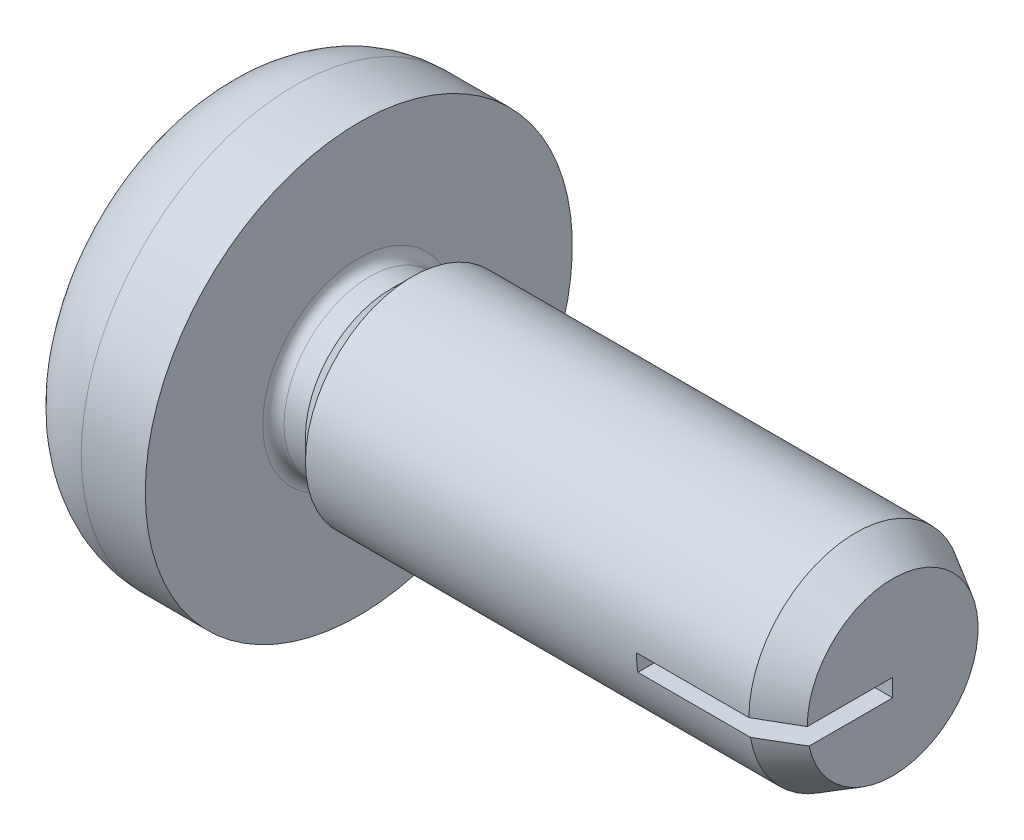
ISO-10303-21;
HEADER;
FILE_DESCRIPTION(('STEP AP214'),'2;1');
FILE_NAME('part.step','',(''),(''),'','','');
FILE_SCHEMA(('AUTOMOTIVE_DESIGN { 1 0 10303 214 1 1 1 1 }'));
ENDSEC;
DATA;
#1=APPLICATION_CONTEXT('core data for automotive mechanical design processes');
#2=APPLICATION_PROTOCOL_DEFINITION('international standard','automotive_design',2000,#1);
#3=PRODUCT_CONTEXT('',#1,'mechanical');
#4=PRODUCT('Part','Part','',(#3));
#5=PRODUCT_RELATED_PRODUCT_CATEGORY('part','',(#4));
#6=PRODUCT_DEFINITION_FORMATION('','',#4);
#7=PRODUCT_DEFINITION_CONTEXT('part definition',#1,'design');
#8=PRODUCT_DEFINITION('design','',#6,#7);
#9=PRODUCT_DEFINITION_SHAPE('','',#8);
#10=(LENGTH_UNIT() NAMED_UNIT(*) SI_UNIT(.MILLI.,.METRE.));
#11=(NAMED_UNIT(*) PLANE_ANGLE_UNIT() SI_UNIT($,.RADIAN.));
#12=(NAMED_UNIT(*) SI_UNIT($,.STERADIAN.) SOLID_ANGLE_UNIT());
#13=UNCERTAINTY_MEASURE_WITH_UNIT(LENGTH_MEASURE(1.E-05),#10,'distance_accuracy_value','');
#14=(GEOMETRIC_REPRESENTATION_CONTEXT(3) GLOBAL_UNCERTAINTY_ASSIGNED_CONTEXT((#13)) GLOBAL_UNIT_ASSIGNED_CONTEXT((#10,
#11,#12)) REPRESENTATION_CONTEXT('',''));
#15=CARTESIAN_POINT('',(0.,0.,0.));
#16=DIRECTION('',(0.,0.,1.));
#17=DIRECTION('',(1.,0.,0.));
#18=AXIS2_PLACEMENT_3D('',#15,#16,#17);
#19=CARTESIAN_POINT('',(0.,0.,0.));
#20=DIRECTION('',(-1.,0.,0.));
#21=DIRECTION('',(0.,0.,1.));
#22=AXIS2_PLACEMENT_3D('',#19,#20,#21);
#23=CYLINDRICAL_SURFACE('',#22,4.);
#24=CARTESIAN_POINT('',(7.6,0.,0.));
#25=DIRECTION('',(-1.,0.,0.));
#26=DIRECTION('',(0.,0.,1.));
#27=AXIS2_PLACEMENT_3D('',#24,#25,#26);
#28=CIRCLE('',#27,4.);
#29=CARTESIAN_POINT('',(7.6,0.,4.));
#30=VERTEX_POINT('',#29);
#31=EDGE_CURVE('E234',#30,#30,#28,.T.);
#32=ORIENTED_EDGE('',*,*,#31,.F.);
#33=EDGE_LOOP('',(#32));
#34=FACE_BOUND('',#33,.T.);
#35=DIRECTION('',(-1.,0.,0.));
#36=VECTOR('',#35,1.);
#37=CARTESIAN_POINT('',(0.,0.,4.));
#38=LINE('',#37,#36);
#39=CARTESIAN_POINT('',(24.2143593539449,0.,4.));
#40=VERTEX_POINT('',#39);
#41=CARTESIAN_POINT('',(20.,0.,4.));
#42=VERTEX_POINT('',#41);
#43=EDGE_CURVE('E376',#40,#42,#38,.T.);
#44=ORIENTED_EDGE('',*,*,#43,.F.);
#45=CARTESIAN_POINT('',(24.2143593539449,0.,0.));
#46=DIRECTION('',(-1.,0.,0.));
#47=DIRECTION('',(0.,0.,1.));
#48=AXIS2_PLACEMENT_3D('',#45,#46,#47);
#49=CIRCLE('',#48,4.);
#50=CARTESIAN_POINT('',(24.2143593539449,-0.666666666666667,3.94405318873308));
#51=VERTEX_POINT('',#50);
#52=EDGE_CURVE('E373',#40,#51,#49,.T.);
#53=ORIENTED_EDGE('',*,*,#52,.T.);
#54=DIRECTION('',(-1.,0.,0.));
#55=VECTOR('',#54,1.);
#56=CARTESIAN_POINT('',(0.,-0.66666666666667,3.94405318873308));
#57=LINE('',#56,#55);
#58=CARTESIAN_POINT('',(20.,-0.666666666666667,3.94405318873308));
#59=VERTEX_POINT('',#58);
#60=EDGE_CURVE('E380',#59,#51,#57,.F.);
#61=ORIENTED_EDGE('',*,*,#60,.F.);
#62=CARTESIAN_POINT('',(20.,0.,0.));
#63=DIRECTION('',(1.,0.,0.));
#64=DIRECTION('',(0.,0.,-1.));
#65=AXIS2_PLACEMENT_3D('',#62,#63,#64);
#66=CIRCLE('',#65,4.);
#67=EDGE_CURVE('E43',#42,#59,#66,.T.);
#68=ORIENTED_EDGE('',*,*,#67,.F.);
#69=EDGE_LOOP('',(#44,#53,#61,#68));
#70=FACE_BOUND('',#69,.T.);
#71=ADVANCED_FACE('F70',(#34,#70),#23,.T.);
#72=CARTESIAN_POINT('',(24.2143593539449,0.,0.));
#73=DIRECTION('',(-1.,0.,0.));
#74=DIRECTION('',(0.,0.,1.));
#75=AXIS2_PLACEMENT_3D('',#72,#73,#74);
#76=CONICAL_SURFACE('',#75,4.,0.523598775598293);
#77=ORIENTED_EDGE('',*,*,#52,.F.);
#78=DIRECTION('',(-0.866025403784441,0.,0.499999999999995));
#79=VECTOR('',#78,1.);
#80=CARTESIAN_POINT('',(31.1425625842205,0.,0.));
#81=LINE('',#80,#79);
#82=CARTESIAN_POINT('',(25.6,0.,3.2));
#83=VERTEX_POINT('',#82);
#84=EDGE_CURVE('E378',#40,#83,#81,.F.);
#85=ORIENTED_EDGE('',*,*,#84,.T.);
#86=CARTESIAN_POINT('',(25.6,0.,0.));
#87=DIRECTION('',(-1.,0.,0.));
#88=DIRECTION('',(0.,0.,1.));
#89=AXIS2_PLACEMENT_3D('',#86,#87,#88);
#90=CIRCLE('',#89,3.2);
#91=CARTESIAN_POINT('',(25.6,-0.666666666666667,3.12978522514813));
#92=VERTEX_POINT('',#91);
#93=EDGE_CURVE('E232',#83,#92,#90,.T.);
#94=ORIENTED_EDGE('',*,*,#93,.T.);
#95=CARTESIAN_POINT('',(29.0110225737498,-0.666666666666666,1.03442890570983));
#96=CARTESIAN_POINT('',(28.9546047360862,-0.666666666666666,1.07316230279422));
#97=CARTESIAN_POINT('',(28.8979084191792,-0.666666666666666,1.11148539170131));
#98=CARTESIAN_POINT('',(28.7840766646169,-0.666666666666666,1.18746837836424));
#99=CARTESIAN_POINT('',(28.7269412485431,-0.666666666666666,1.2251283084183));
#100=CARTESIAN_POINT('',(28.6123511503539,-0.666666666666666,1.29994122551413));
#101=CARTESIAN_POINT('',(28.5548965113001,-0.666666666666666,1.33709427870161));
#102=CARTESIAN_POINT('',(28.4397288887015,-0.666666666666666,1.41099927061029));
#103=CARTESIAN_POINT('',(28.3820159015085,-0.666666666666666,1.44775120364183));
#104=CARTESIAN_POINT('',(28.2085999099586,-0.666666666666666,1.55751052864889));
#105=CARTESIAN_POINT('',(28.0925936030097,-0.666666666666666,1.63003848501711));
#106=CARTESIAN_POINT('',(27.860039620016,-0.666666666666666,1.77422946995291));
#107=CARTESIAN_POINT('',(27.7434919213131,-0.666666666666666,1.84589246186038));
#108=CARTESIAN_POINT('',(27.4030460845038,-0.666666666666666,2.05400292151073));
#109=CARTESIAN_POINT('',(27.1786501670724,-0.666666666666666,2.18963540679998));
#110=CARTESIAN_POINT('',(26.7291021401079,-0.666666666666666,2.45963129973836));
#111=CARTESIAN_POINT('',(26.5039500382249,-0.666666666666667,2.59399472017408));
#112=CARTESIAN_POINT('',(26.0531203270533,-0.666666666666667,2.8619414023947));
#113=CARTESIAN_POINT('',(25.827442620258,-0.666666666666667,2.99552450006476));
#114=CARTESIAN_POINT('',(25.3757682789441,-0.666666666666667,3.26215053511295));
#115=CARTESIAN_POINT('',(25.1497716440183,-0.666666666666667,3.39519347180053));
#116=CARTESIAN_POINT('',(24.5796331830894,-0.666666666666667,3.7301906718806));
#117=CARTESIAN_POINT('',(24.2353456495235,-0.666666666666667,3.93189688810902));
#118=CARTESIAN_POINT('',(23.5464530535666,-0.666666666666667,4.33476598611255));
#119=CARTESIAN_POINT('',(23.2018479911485,-0.666666666666667,4.53592886784144));
#120=CARTESIAN_POINT('',(22.5125601596137,-0.666666666666667,4.93781254608102));
#121=CARTESIAN_POINT('',(22.1678774731129,-0.666666666666667,5.13853348432239));
#122=CARTESIAN_POINT('',(21.4783597959242,-0.666666666666667,5.53971245147009));
#123=CARTESIAN_POINT('',(21.1335248054617,-0.666666666666667,5.74017048076359));
#124=CARTESIAN_POINT('',(20.7886429402508,-0.666666666666667,5.94054763638404));
#125=B_SPLINE_CURVE_WITH_KNOTS('',3,(#95,#96,#97,#98,#99,#100,#101,#102,#103,#104,#105,#106,
#107,#108,#109,#110,#111,#112,#113,#114,#115,#116,#117,#118,#119,#120,#121,#122,#123,#124),
.UNSPECIFIED.,.F.,.F.,(4,2,2,2,2,2,2,2,2,2,2,2,2,2,4),(0.,0.205297188000717,0.410584349476784,
0.615844460372571,0.821107478990558,1.23153958067163,1.6419890171869,2.42858471812644,
3.21517248516028,4.00192012329789,4.78866876690041,5.98573664629052,7.18280462748485,
8.37940611176341,9.57600583190403),.UNSPECIFIED.);
#126=EDGE_CURVE('E382',#92,#51,#125,.T.);
#127=ORIENTED_EDGE('',*,*,#126,.T.);
#128=EDGE_LOOP('',(#77,#85,#94,#127));
#129=FACE_BOUND('',#128,.T.);
#130=ADVANCED_FACE('F392',(#129),#76,.T.);
#131=CARTESIAN_POINT('',(25.6,4.,0.));
#132=DIRECTION('',(-1.,0.,0.));
#133=DIRECTION('',(0.,0.,1.));
#134=AXIS2_PLACEMENT_3D('',#131,#132,#133);
#135=PLANE('',#134);
#136=DIRECTION('',(0.,0.,1.));
#137=VECTOR('',#136,1.);
#138=CARTESIAN_POINT('',(25.6,0.,0.));
#139=LINE('',#138,#137);
#140=CARTESIAN_POINT('',(25.6,0.,0.));
#141=VERTEX_POINT('',#140);
#142=EDGE_CURVE('E78',#141,#83,#139,.T.);
#143=ORIENTED_EDGE('',*,*,#142,.F.);
#144=DIRECTION('',(0.,1.,0.));
#145=VECTOR('',#144,1.);
#146=CARTESIAN_POINT('',(25.6,0.,0.));
#147=LINE('',#146,#145);
#148=CARTESIAN_POINT('',(25.6,-0.666666666666668,0.));
#149=VERTEX_POINT('',#148);
#150=EDGE_CURVE('E222',#149,#141,#147,.T.);
#151=ORIENTED_EDGE('',*,*,#150,.F.);
#152=DIRECTION('',(0.,0.,-1.));
#153=VECTOR('',#152,1.);
#154=CARTESIAN_POINT('',(25.6,-0.666666666666667,0.));
#155=LINE('',#154,#153);
#156=EDGE_CURVE('E233',#92,#149,#155,.T.);
#157=ORIENTED_EDGE('',*,*,#156,.F.);
#158=ORIENTED_EDGE('',*,*,#93,.F.);
#159=EDGE_LOOP('',(#143,#151,#157,#158));
#160=FACE_BOUND('',#159,.T.);
#161=ADVANCED_FACE('F230',(#160),#135,.F.);
#162=CARTESIAN_POINT('',(0.,0.,0.));
#163=DIRECTION('',(1.,0.,0.));
#164=DIRECTION('',(0.,0.,-1.));
#165=AXIS2_PLACEMENT_3D('',#162,#163,#164);
#166=PLANE('',#165);
#167=CARTESIAN_POINT('',(0.,0.,0.));
#168=DIRECTION('',(-1.,0.,0.));
#169=DIRECTION('',(0.,0.,1.));
#170=AXIS2_PLACEMENT_3D('',#167,#168,#169);
#171=CIRCLE('',#170,4.8);
#172=CARTESIAN_POINT('',(0.,0.,4.8));
#173=VERTEX_POINT('',#172);
#174=EDGE_CURVE('E260',#173,#173,#171,.T.);
#175=ORIENTED_EDGE('',*,*,#174,.T.);
#176=EDGE_LOOP('',(#175));
#177=FACE_BOUND('',#176,.T.);
#178=DIRECTION('',(0.,0.,-1.));
#179=VECTOR('',#178,1.);
#180=CARTESIAN_POINT('',(0.,-0.9,0.899999999999999));
#181=LINE('',#180,#179);
#182=CARTESIAN_POINT('',(0.,-0.9,4.39));
#183=VERTEX_POINT('',#182);
#184=CARTESIAN_POINT('',(0.,-0.899999999999999,1.778));
#185=VERTEX_POINT('',#184);
#186=EDGE_CURVE('E309',#183,#185,#181,.T.);
#187=ORIENTED_EDGE('',*,*,#186,.T.);
#188=DIRECTION('',(0.,0.707106781186548,0.707106781186547));
#189=VECTOR('',#188,1.);
#190=CARTESIAN_POINT('',(0.,-1.778,0.9));
#191=LINE('',#190,#189);
#192=CARTESIAN_POINT('',(0.,-1.778,0.9));
#193=VERTEX_POINT('',#192);
#194=EDGE_CURVE('E368',#193,#185,#191,.T.);
#195=ORIENTED_EDGE('',*,*,#194,.F.);
#196=DIRECTION('',(0.,-1.,0.));
#197=VECTOR('',#196,1.);
#198=CARTESIAN_POINT('',(0.,-0.9,0.899999999999999));
#199=LINE('',#198,#197);
#200=CARTESIAN_POINT('',(0.,-4.39,0.9));
#201=VERTEX_POINT('',#200);
#202=EDGE_CURVE('E307',#193,#201,#199,.T.);
#203=ORIENTED_EDGE('',*,*,#202,.T.);
#204=DIRECTION('',(0.,0.,-1.));
#205=VECTOR('',#204,1.);
#206=CARTESIAN_POINT('',(0.,-4.39,-0.9));
#207=LINE('',#206,#205);
#208=CARTESIAN_POINT('',(0.,-4.39,-0.9));
#209=VERTEX_POINT('',#208);
#210=EDGE_CURVE('E304',#201,#209,#207,.T.);
#211=ORIENTED_EDGE('',*,*,#210,.T.);
#212=DIRECTION('',(0.,1.,0.));
#213=VECTOR('',#212,1.);
#214=CARTESIAN_POINT('',(0.,-0.9,-0.9));
#215=LINE('',#214,#213);
#216=CARTESIAN_POINT('',(0.,-1.778,-0.9));
#217=VERTEX_POINT('',#216);
#218=EDGE_CURVE('E301',#209,#217,#215,.T.);
#219=ORIENTED_EDGE('',*,*,#218,.T.);
#220=DIRECTION('',(0.,-0.707106781186548,0.707106781186547));
#221=VECTOR('',#220,1.);
#222=CARTESIAN_POINT('',(0.,-1.778,-0.9));
#223=LINE('',#222,#221);
#224=CARTESIAN_POINT('',(0.,-0.899999999999999,-1.778));
#225=VERTEX_POINT('',#224);
#226=EDGE_CURVE('E359',#225,#217,#223,.T.);
#227=ORIENTED_EDGE('',*,*,#226,.F.);
#228=DIRECTION('',(0.,0.,-1.));
#229=VECTOR('',#228,1.);
#230=CARTESIAN_POINT('',(0.,-0.9,-4.39));
#231=LINE('',#230,#229);
#232=CARTESIAN_POINT('',(0.,-0.9,-4.39));
#233=VERTEX_POINT('',#232);
#234=EDGE_CURVE('E299',#225,#233,#231,.T.);
#235=ORIENTED_EDGE('',*,*,#234,.T.);
#236=DIRECTION('',(0.,1.,0.));
#237=VECTOR('',#236,1.);
#238=CARTESIAN_POINT('',(0.,0.9,-4.39));
#239=LINE('',#238,#237);
#240=CARTESIAN_POINT('',(0.,0.9,-4.39));
#241=VERTEX_POINT('',#240);
#242=EDGE_CURVE('E296',#233,#241,#239,.T.);
#243=ORIENTED_EDGE('',*,*,#242,.T.);
#244=DIRECTION('',(0.,0.,1.));
#245=VECTOR('',#244,1.);
#246=CARTESIAN_POINT('',(0.,0.9,-4.39));
#247=LINE('',#246,#245);
#248=CARTESIAN_POINT('',(0.,0.9,-1.778));
#249=VERTEX_POINT('',#248);
#250=EDGE_CURVE('E293',#241,#249,#247,.T.);
#251=ORIENTED_EDGE('',*,*,#250,.T.);
#252=DIRECTION('',(0.,-0.707106781186548,-0.707106781186547));
#253=VECTOR('',#252,1.);
#254=CARTESIAN_POINT('',(0.,1.778,-0.9));
#255=LINE('',#254,#253);
#256=CARTESIAN_POINT('',(0.,1.778,-0.9));
#257=VERTEX_POINT('',#256);
#258=EDGE_CURVE('E351',#257,#249,#255,.T.);
#259=ORIENTED_EDGE('',*,*,#258,.F.);
#260=DIRECTION('',(0.,1.,0.));
#261=VECTOR('',#260,1.);
#262=CARTESIAN_POINT('',(0.,4.39,-0.9));
#263=LINE('',#262,#261);
#264=CARTESIAN_POINT('',(0.,4.39,-0.9));
#265=VERTEX_POINT('',#264);
#266=EDGE_CURVE('E323',#257,#265,#263,.T.);
#267=ORIENTED_EDGE('',*,*,#266,.T.);
#268=DIRECTION('',(0.,0.,1.));
#269=VECTOR('',#268,1.);
#270=CARTESIAN_POINT('',(0.,4.39,-0.9));
#271=LINE('',#270,#269);
#272=CARTESIAN_POINT('',(0.,4.39,0.9));
#273=VERTEX_POINT('',#272);
#274=EDGE_CURVE('E320',#265,#273,#271,.T.);
#275=ORIENTED_EDGE('',*,*,#274,.T.);
#276=DIRECTION('',(0.,-1.,0.));
#277=VECTOR('',#276,1.);
#278=CARTESIAN_POINT('',(0.,4.39,0.9));
#279=LINE('',#278,#277);
#280=CARTESIAN_POINT('',(0.,1.778,0.9));
#281=VERTEX_POINT('',#280);
#282=EDGE_CURVE('E317',#273,#281,#279,.T.);
#283=ORIENTED_EDGE('',*,*,#282,.T.);
#284=DIRECTION('',(0.,0.707106781186548,-0.707106781186547));
#285=VECTOR('',#284,1.);
#286=CARTESIAN_POINT('',(0.,1.778,0.9));
#287=LINE('',#286,#285);
#288=CARTESIAN_POINT('',(0.,0.9,1.778));
#289=VERTEX_POINT('',#288);
#290=EDGE_CURVE('E341',#289,#281,#287,.T.);
#291=ORIENTED_EDGE('',*,*,#290,.F.);
#292=DIRECTION('',(0.,0.,1.));
#293=VECTOR('',#292,1.);
#294=CARTESIAN_POINT('',(0.,0.9,0.9));
#295=LINE('',#294,#293);
#296=CARTESIAN_POINT('',(0.,0.9,4.39));
#297=VERTEX_POINT('',#296);
#298=EDGE_CURVE('E315',#289,#297,#295,.T.);
#299=ORIENTED_EDGE('',*,*,#298,.T.);
#300=DIRECTION('',(0.,-1.,0.));
#301=VECTOR('',#300,1.);
#302=CARTESIAN_POINT('',(0.,0.9,4.39));
#303=LINE('',#302,#301);
#304=EDGE_CURVE('E312',#297,#183,#303,.T.);
#305=ORIENTED_EDGE('',*,*,#304,.T.);
#306=EDGE_LOOP('',(#187,#195,#203,#211,#219,#227,#235,#243,#251,#259,#267,#275,#283,#291,#299,#305));
#307=FACE_BOUND('',#306,.T.);
#308=ADVANCED_FACE('F424',(#177,#307),#166,.F.);
#309=CARTESIAN_POINT('',(7.6,0.,0.));
#310=DIRECTION('',(1.,0.,0.));
#311=DIRECTION('',(0.,0.,-1.));
#312=AXIS2_PLACEMENT_3D('',#309,#310,#311);
#313=CONICAL_SURFACE('',#312,4.,0.78539816339745);
#314=CARTESIAN_POINT('',(6.8,0.,0.));
#315=DIRECTION('',(-1.,0.,0.));
#316=DIRECTION('',(0.,0.,1.));
#317=AXIS2_PLACEMENT_3D('',#314,#315,#316);
#318=CIRCLE('',#317,3.2);
#319=CARTESIAN_POINT('',(6.8,0.,3.2));
#320=VERTEX_POINT('',#319);
#321=EDGE_CURVE('E276',#320,#320,#318,.T.);
#322=ORIENTED_EDGE('',*,*,#321,.F.);
#323=EDGE_LOOP('',(#322));
#324=FACE_BOUND('',#323,.T.);
#325=ORIENTED_EDGE('',*,*,#31,.T.);
#326=EDGE_LOOP('',(#325));
#327=FACE_BOUND('',#326,.T.);
#328=ADVANCED_FACE('F420',(#324,#327),#313,.T.);
#329=CARTESIAN_POINT('',(0.,0.,0.));
#330=DIRECTION('',(-1.,0.,0.));
#331=DIRECTION('',(0.,0.,1.));
#332=AXIS2_PLACEMENT_3D('',#329,#330,#331);
#333=CYLINDRICAL_SURFACE('',#332,3.2);
#334=CARTESIAN_POINT('',(6.,0.,0.));
#335=DIRECTION('',(-1.,0.,0.));
#336=DIRECTION('',(0.,0.,1.));
#337=AXIS2_PLACEMENT_3D('',#334,#335,#336);
#338=CIRCLE('',#337,3.2);
#339=CARTESIAN_POINT('',(6.,0.,3.2));
#340=VERTEX_POINT('',#339);
#341=EDGE_CURVE('E279',#340,#340,#338,.T.);
#342=ORIENTED_EDGE('',*,*,#341,.F.);
#343=EDGE_LOOP('',(#342));
#344=FACE_BOUND('',#343,.T.);
#345=ORIENTED_EDGE('',*,*,#321,.T.);
#346=EDGE_LOOP('',(#345));
#347=FACE_BOUND('',#346,.T.);
#348=ADVANCED_FACE('F547',(#344,#347),#333,.T.);
#349=CARTESIAN_POINT('',(6.,0.,0.));
#350=DIRECTION('',(-1.,0.,0.));
#351=DIRECTION('',(0.,0.,1.));
#352=AXIS2_PLACEMENT_3D('',#349,#350,#351);
#353=TOROIDAL_SURFACE('',#352,3.6,0.400000000000001);
#354=CARTESIAN_POINT('',(5.6,0.,0.));
#355=DIRECTION('',(-1.,0.,0.));
#356=DIRECTION('',(0.,0.,1.));
#357=AXIS2_PLACEMENT_3D('',#354,#355,#356);
#358=CIRCLE('',#357,3.6);
#359=CARTESIAN_POINT('',(5.6,0.,3.6));
#360=VERTEX_POINT('',#359);
#361=EDGE_CURVE('E282',#360,#360,#358,.T.);
#362=ORIENTED_EDGE('',*,*,#361,.F.);
#363=EDGE_LOOP('',(#362));
#364=FACE_BOUND('',#363,.T.);
#365=ORIENTED_EDGE('',*,*,#341,.T.);
#366=EDGE_LOOP('',(#365));
#367=FACE_BOUND('',#366,.T.);
#368=ADVANCED_FACE('F544',(#364,#367),#353,.F.);
#369=CARTESIAN_POINT('',(5.6,8.,0.));
#370=DIRECTION('',(-1.,0.,0.));
#371=DIRECTION('',(0.,0.,1.));
#372=AXIS2_PLACEMENT_3D('',#369,#370,#371);
#373=PLANE('',#372);
#374=CARTESIAN_POINT('',(5.6,0.,0.));
#375=DIRECTION('',(-1.,0.,0.));
#376=DIRECTION('',(0.,0.,1.));
#377=AXIS2_PLACEMENT_3D('',#374,#375,#376);
#378=CIRCLE('',#377,8.);
#379=CARTESIAN_POINT('',(5.6,0.,8.));
#380=VERTEX_POINT('',#379);
#381=EDGE_CURVE('E285',#380,#380,#378,.T.);
#382=ORIENTED_EDGE('',*,*,#381,.F.);
#383=EDGE_LOOP('',(#382));
#384=FACE_BOUND('',#383,.T.);
#385=ORIENTED_EDGE('',*,*,#361,.T.);
#386=EDGE_LOOP('',(#385));
#387=FACE_BOUND('',#386,.T.);
#388=ADVANCED_FACE('F540',(#384,#387),#373,.F.);
#389=CARTESIAN_POINT('',(0.,0.,0.));
#390=DIRECTION('',(-1.,0.,0.));
#391=DIRECTION('',(0.,0.,1.));
#392=AXIS2_PLACEMENT_3D('',#389,#390,#391);
#393=CYLINDRICAL_SURFACE('',#392,8.);
#394=CARTESIAN_POINT('',(3.2,0.,0.));
#395=DIRECTION('',(-1.,0.,0.));
#396=DIRECTION('',(0.,0.,1.));
#397=AXIS2_PLACEMENT_3D('',#394,#395,#396);
#398=CIRCLE('',#397,8.);
#399=CARTESIAN_POINT('',(3.2,0.,8.));
#400=VERTEX_POINT('',#399);
#401=EDGE_CURVE('E288',#400,#400,#398,.T.);
#402=ORIENTED_EDGE('',*,*,#401,.F.);
#403=EDGE_LOOP('',(#402));
#404=FACE_BOUND('',#403,.T.);
#405=ORIENTED_EDGE('',*,*,#381,.T.);
#406=EDGE_LOOP('',(#405));
#407=FACE_BOUND('',#406,.T.);
#408=ADVANCED_FACE('F536',(#404,#407),#393,.T.);
#409=CARTESIAN_POINT('',(3.2,0.,0.));
#410=DIRECTION('',(-1.,0.,0.));
#411=DIRECTION('',(0.,0.,1.));
#412=AXIS2_PLACEMENT_3D('',#409,#410,#411);
#413=TOROIDAL_SURFACE('',#412,4.8,3.2);
#414=ORIENTED_EDGE('',*,*,#174,.F.);
#415=EDGE_LOOP('',(#414));
#416=FACE_BOUND('',#415,.T.);
#417=ORIENTED_EDGE('',*,*,#401,.T.);
#418=EDGE_LOOP('',(#417));
#419=FACE_BOUND('',#418,.T.);
#420=ADVANCED_FACE('F530',(#416,#419),#413,.T.);
#421=CARTESIAN_POINT('',(4.,4.39,-0.9));
#422=DIRECTION('',(0.,0.,1.));
#423=DIRECTION('',(1.,0.,0.));
#424=AXIS2_PLACEMENT_3D('',#421,#422,#423);
#425=PLANE('',#424);
#426=DIRECTION('',(-1.,0.,0.));
#427=VECTOR('',#426,1.);
#428=CARTESIAN_POINT('',(5.24167950776358,1.778,-0.9));
#429=LINE('',#428,#427);
#430=CARTESIAN_POINT('',(4.,1.778,-0.9));
#431=VERTEX_POINT('',#430);
#432=EDGE_CURVE('E349',#431,#257,#429,.T.);
#433=ORIENTED_EDGE('',*,*,#432,.F.);
#434=DIRECTION('',(0.,1.,0.));
#435=VECTOR('',#434,1.);
#436=CARTESIAN_POINT('',(4.,4.39,-0.9));
#437=LINE('',#436,#435);
#438=CARTESIAN_POINT('',(4.,2.93411906293519,-0.9));
#439=VERTEX_POINT('',#438);
#440=EDGE_CURVE('E264',#431,#439,#437,.T.);
#441=ORIENTED_EDGE('',*,*,#440,.T.);
#442=DIRECTION('',(-0.939692620785908,0.342020143325669,0.));
#443=VECTOR('',#442,1.);
#444=CARTESIAN_POINT('',(0.,4.39,-0.9));
#445=LINE('',#444,#443);
#446=EDGE_CURVE('E257',#439,#265,#445,.T.);
#447=ORIENTED_EDGE('',*,*,#446,.T.);
#448=ORIENTED_EDGE('',*,*,#266,.F.);
#449=EDGE_LOOP('',(#433,#441,#447,#448));
#450=FACE_BOUND('',#449,.T.);
#451=ADVANCED_FACE('F497',(#450),#425,.T.);
#452=CARTESIAN_POINT('',(0.,4.39,-0.9));
#453=DIRECTION('',(-0.342020143325669,-0.939692620785908,0.));
#454=DIRECTION('',(0.939692620785908,-0.342020143325669,0.));
#455=AXIS2_PLACEMENT_3D('',#452,#453,#454);
#456=PLANE('',#455);
#457=ORIENTED_EDGE('',*,*,#274,.F.);
#458=ORIENTED_EDGE('',*,*,#446,.F.);
#459=DIRECTION('',(0.,0.,1.));
#460=VECTOR('',#459,1.);
#461=CARTESIAN_POINT('',(4.,2.93411906293519,-0.9));
#462=LINE('',#461,#460);
#463=CARTESIAN_POINT('',(4.,2.93411906293519,0.9));
#464=VERTEX_POINT('',#463);
#465=EDGE_CURVE('E261',#439,#464,#462,.T.);
#466=ORIENTED_EDGE('',*,*,#465,.T.);
#467=DIRECTION('',(-0.939692620785908,0.342020143325669,0.));
#468=VECTOR('',#467,1.);
#469=CARTESIAN_POINT('',(3.53208888623795,3.10442478062692,0.9));
#470=LINE('',#469,#468);
#471=EDGE_CURVE('E251',#464,#273,#470,.T.);
#472=ORIENTED_EDGE('',*,*,#471,.T.);
#473=EDGE_LOOP('',(#457,#458,#466,#472));
#474=FACE_BOUND('',#473,.T.);
#475=ADVANCED_FACE('F72',(#474),#456,.T.);
#476=CARTESIAN_POINT('',(4.,4.39,0.9));
#477=DIRECTION('',(0.,0.,-1.));
#478=DIRECTION('',(0.,1.,0.));
#479=AXIS2_PLACEMENT_3D('',#476,#477,#478);
#480=PLANE('',#479);
#481=DIRECTION('',(-1.,0.,0.));
#482=VECTOR('',#481,1.);
#483=CARTESIAN_POINT('',(5.24167950776358,1.778,0.9));
#484=LINE('',#483,#482);
#485=CARTESIAN_POINT('',(4.,1.778,0.9));
#486=VERTEX_POINT('',#485);
#487=EDGE_CURVE('E340',#486,#281,#484,.T.);
#488=ORIENTED_EDGE('',*,*,#487,.T.);
#489=ORIENTED_EDGE('',*,*,#282,.F.);
#490=ORIENTED_EDGE('',*,*,#471,.F.);
#491=DIRECTION('',(0.,-1.,0.));
#492=VECTOR('',#491,1.);
#493=CARTESIAN_POINT('',(4.,4.39,0.9));
#494=LINE('',#493,#492);
#495=EDGE_CURVE('E263',#464,#486,#494,.T.);
#496=ORIENTED_EDGE('',*,*,#495,.T.);
#497=EDGE_LOOP('',(#488,#489,#490,#496));
#498=FACE_BOUND('',#497,.T.);
#499=ADVANCED_FACE('F447',(#498),#480,.T.);
#500=CARTESIAN_POINT('',(4.,0.9,0.9));
#501=DIRECTION('',(0.,-1.,0.));
#502=DIRECTION('',(0.,0.,-1.));
#503=AXIS2_PLACEMENT_3D('',#500,#501,#502);
#504=PLANE('',#503);
#505=DIRECTION('',(-1.,0.,0.));
#506=VECTOR('',#505,1.);
#507=CARTESIAN_POINT('',(5.24167950776358,0.9,1.778));
#508=LINE('',#507,#506);
#509=CARTESIAN_POINT('',(4.,0.9,1.778));
#510=VERTEX_POINT('',#509);
#511=EDGE_CURVE('E338',#510,#289,#508,.T.);
#512=ORIENTED_EDGE('',*,*,#511,.F.);
#513=DIRECTION('',(0.,0.,1.));
#514=VECTOR('',#513,1.);
#515=CARTESIAN_POINT('',(4.,0.9,0.9));
#516=LINE('',#515,#514);
#517=CARTESIAN_POINT('',(4.,0.9,2.93411906293519));
#518=VERTEX_POINT('',#517);
#519=EDGE_CURVE('E255',#510,#518,#516,.T.);
#520=ORIENTED_EDGE('',*,*,#519,.T.);
#521=DIRECTION('',(-0.939692620785908,0.,0.342020143325669));
#522=VECTOR('',#521,1.);
#523=CARTESIAN_POINT('',(0.,0.9,4.39));
#524=LINE('',#523,#522);
#525=EDGE_CURVE('E248',#518,#297,#524,.T.);
#526=ORIENTED_EDGE('',*,*,#525,.T.);
#527=ORIENTED_EDGE('',*,*,#298,.F.);
#528=EDGE_LOOP('',(#512,#520,#526,#527));
#529=FACE_BOUND('',#528,.T.);
#530=ADVANCED_FACE('F439',(#529),#504,.T.);
#531=CARTESIAN_POINT('',(0.,0.9,4.39));
#532=DIRECTION('',(-0.342020143325669,0.,-0.939692620785908));
#533=DIRECTION('',(-0.939692620785908,0.,0.342020143325669));
#534=AXIS2_PLACEMENT_3D('',#531,#532,#533);
#535=PLANE('',#534);
#536=ORIENTED_EDGE('',*,*,#304,.F.);
#537=ORIENTED_EDGE('',*,*,#525,.F.);
#538=DIRECTION('',(0.,-1.,0.));
#539=VECTOR('',#538,1.);
#540=CARTESIAN_POINT('',(4.,0.9,2.93411906293519));
#541=LINE('',#540,#539);
#542=CARTESIAN_POINT('',(4.,-0.9,2.93411906293519));
#543=VERTEX_POINT('',#542);
#544=EDGE_CURVE('E252',#518,#543,#541,.T.);
#545=ORIENTED_EDGE('',*,*,#544,.T.);
#546=DIRECTION('',(-0.939692620785908,0.,0.342020143325669));
#547=VECTOR('',#546,1.);
#548=CARTESIAN_POINT('',(4.65375326514097,-0.9,2.69617233386953));
#549=LINE('',#548,#547);
#550=EDGE_CURVE('E240',#543,#183,#549,.T.);
#551=ORIENTED_EDGE('',*,*,#550,.T.);
#552=EDGE_LOOP('',(#536,#537,#545,#551));
#553=FACE_BOUND('',#552,.T.);
#554=ADVANCED_FACE('F436',(#553),#535,.T.);
#555=CARTESIAN_POINT('',(4.,-0.9,0.899999999999999));
#556=DIRECTION('',(0.,1.,0.));
#557=DIRECTION('',(0.,0.,1.));
#558=AXIS2_PLACEMENT_3D('',#555,#556,#557);
#559=PLANE('',#558);
#560=DIRECTION('',(-1.,0.,0.));
#561=VECTOR('',#560,1.);
#562=CARTESIAN_POINT('',(5.24167950776358,-0.899999999999999,1.778));
#563=LINE('',#562,#561);
#564=CARTESIAN_POINT('',(4.,-0.9,1.778));
#565=VERTEX_POINT('',#564);
#566=EDGE_CURVE('E365',#565,#185,#563,.T.);
#567=ORIENTED_EDGE('',*,*,#566,.T.);
#568=ORIENTED_EDGE('',*,*,#186,.F.);
#569=ORIENTED_EDGE('',*,*,#550,.F.);
#570=DIRECTION('',(0.,0.,-1.));
#571=VECTOR('',#570,1.);
#572=CARTESIAN_POINT('',(4.,-0.9,0.899999999999999));
#573=LINE('',#572,#571);
#574=EDGE_CURVE('E254',#543,#565,#573,.T.);
#575=ORIENTED_EDGE('',*,*,#574,.T.);
#576=EDGE_LOOP('',(#567,#568,#569,#575));
#577=FACE_BOUND('',#576,.T.);
#578=ADVANCED_FACE('F438',(#577),#559,.T.);
#579=CARTESIAN_POINT('',(4.,-0.9,0.899999999999999));
#580=DIRECTION('',(0.,0.,-1.));
#581=DIRECTION('',(0.,1.,0.));
#582=AXIS2_PLACEMENT_3D('',#579,#580,#581);
#583=PLANE('',#582);
#584=DIRECTION('',(-1.,0.,0.));
#585=VECTOR('',#584,1.);
#586=CARTESIAN_POINT('',(5.24167950776358,-1.778,0.9));
#587=LINE('',#586,#585);
#588=CARTESIAN_POINT('',(4.,-1.778,0.9));
#589=VERTEX_POINT('',#588);
#590=EDGE_CURVE('E366',#589,#193,#587,.T.);
#591=ORIENTED_EDGE('',*,*,#590,.F.);
#592=DIRECTION('',(0.,-1.,0.));
#593=VECTOR('',#592,1.);
#594=CARTESIAN_POINT('',(4.,-0.9,0.899999999999999));
#595=LINE('',#594,#593);
#596=CARTESIAN_POINT('',(4.,-2.93411906293519,0.9));
#597=VERTEX_POINT('',#596);
#598=EDGE_CURVE('E245',#589,#597,#595,.T.);
#599=ORIENTED_EDGE('',*,*,#598,.T.);
#600=DIRECTION('',(-0.939692620785908,-0.342020143325669,0.));
#601=VECTOR('',#600,1.);
#602=CARTESIAN_POINT('',(0.,-4.39,0.9));
#603=LINE('',#602,#601);
#604=EDGE_CURVE('E237',#597,#201,#603,.T.);
#605=ORIENTED_EDGE('',*,*,#604,.T.);
#606=ORIENTED_EDGE('',*,*,#202,.F.);
#607=EDGE_LOOP('',(#591,#599,#605,#606));
#608=FACE_BOUND('',#607,.T.);
#609=ADVANCED_FACE('F434',(#608),#583,.T.);
#610=CARTESIAN_POINT('',(0.,-4.39,-0.9));
#611=DIRECTION('',(-0.342020143325669,0.939692620785908,0.));
#612=DIRECTION('',(-0.939692620785908,-0.342020143325669,0.));
#613=AXIS2_PLACEMENT_3D('',#610,#611,#612);
#614=PLANE('',#613);
#615=ORIENTED_EDGE('',*,*,#210,.F.);
#616=ORIENTED_EDGE('',*,*,#604,.F.);
#617=DIRECTION('',(0.,0.,-1.));
#618=VECTOR('',#617,1.);
#619=CARTESIAN_POINT('',(4.,-2.93411906293519,-0.9));
#620=LINE('',#619,#618);
#621=CARTESIAN_POINT('',(4.,-2.93411906293519,-0.9));
#622=VERTEX_POINT('',#621);
#623=EDGE_CURVE('E242',#597,#622,#620,.T.);
#624=ORIENTED_EDGE('',*,*,#623,.T.);
#625=DIRECTION('',(-0.939692620785908,-0.342020143325669,0.));
#626=VECTOR('',#625,1.);
#627=CARTESIAN_POINT('',(4.65375326514097,-2.69617233386953,-0.9));
#628=LINE('',#627,#626);
#629=EDGE_CURVE('E241',#622,#209,#628,.T.);
#630=ORIENTED_EDGE('',*,*,#629,.T.);
#631=EDGE_LOOP('',(#615,#616,#624,#630));
#632=FACE_BOUND('',#631,.T.);
#633=ADVANCED_FACE('F431',(#632),#614,.T.);
#634=CARTESIAN_POINT('',(4.,-0.9,-0.9));
#635=DIRECTION('',(0.,0.,1.));
#636=DIRECTION('',(1.,0.,0.));
#637=AXIS2_PLACEMENT_3D('',#634,#635,#636);
#638=PLANE('',#637);
#639=DIRECTION('',(-1.,0.,0.));
#640=VECTOR('',#639,1.);
#641=CARTESIAN_POINT('',(5.24167950776358,-1.778,-0.9));
#642=LINE('',#641,#640);
#643=CARTESIAN_POINT('',(4.,-1.778,-0.9));
#644=VERTEX_POINT('',#643);
#645=EDGE_CURVE('E358',#644,#217,#642,.T.);
#646=ORIENTED_EDGE('',*,*,#645,.T.);
#647=ORIENTED_EDGE('',*,*,#218,.F.);
#648=ORIENTED_EDGE('',*,*,#629,.F.);
#649=DIRECTION('',(0.,1.,0.));
#650=VECTOR('',#649,1.);
#651=CARTESIAN_POINT('',(4.,-0.9,-0.9));
#652=LINE('',#651,#650);
#653=EDGE_CURVE('E244',#622,#644,#652,.T.);
#654=ORIENTED_EDGE('',*,*,#653,.T.);
#655=EDGE_LOOP('',(#646,#647,#648,#654));
#656=FACE_BOUND('',#655,.T.);
#657=ADVANCED_FACE('F433',(#656),#638,.T.);
#658=CARTESIAN_POINT('',(4.,-0.9,-4.39));
#659=DIRECTION('',(0.,1.,0.));
#660=DIRECTION('',(0.,0.,1.));
#661=AXIS2_PLACEMENT_3D('',#658,#659,#660);
#662=PLANE('',#661);
#663=DIRECTION('',(-1.,0.,0.));
#664=VECTOR('',#663,1.);
#665=CARTESIAN_POINT('',(5.24167950776358,-0.899999999999999,-1.778));
#666=LINE('',#665,#664);
#667=CARTESIAN_POINT('',(4.,-0.899999999999999,-1.778));
#668=VERTEX_POINT('',#667);
#669=EDGE_CURVE('E356',#668,#225,#666,.T.);
#670=ORIENTED_EDGE('',*,*,#669,.F.);
#671=DIRECTION('',(0.,0.,-1.));
#672=VECTOR('',#671,1.);
#673=CARTESIAN_POINT('',(4.,-0.9,-4.39));
#674=LINE('',#673,#672);
#675=CARTESIAN_POINT('',(4.,-0.9,-2.93411906293519));
#676=VERTEX_POINT('',#675);
#677=EDGE_CURVE('E272',#668,#676,#674,.T.);
#678=ORIENTED_EDGE('',*,*,#677,.T.);
#679=DIRECTION('',(-0.939692620785908,0.,-0.342020143325669));
#680=VECTOR('',#679,1.);
#681=CARTESIAN_POINT('',(0.,-0.9,-4.39));
#682=LINE('',#681,#680);
#683=EDGE_CURVE('E247',#676,#233,#682,.T.);
#684=ORIENTED_EDGE('',*,*,#683,.T.);
#685=ORIENTED_EDGE('',*,*,#234,.F.);
#686=EDGE_LOOP('',(#670,#678,#684,#685));
#687=FACE_BOUND('',#686,.T.);
#688=ADVANCED_FACE('F429',(#687),#662,.T.);
#689=CARTESIAN_POINT('',(0.,0.9,-4.39));
#690=DIRECTION('',(-0.342020143325669,0.,0.939692620785908));
#691=DIRECTION('',(0.939692620785908,0.,0.342020143325669));
#692=AXIS2_PLACEMENT_3D('',#689,#690,#691);
#693=PLANE('',#692);
#694=ORIENTED_EDGE('',*,*,#242,.F.);
#695=ORIENTED_EDGE('',*,*,#683,.F.);
#696=DIRECTION('',(0.,1.,0.));
#697=VECTOR('',#696,1.);
#698=CARTESIAN_POINT('',(4.,0.9,-2.93411906293519));
#699=LINE('',#698,#697);
#700=CARTESIAN_POINT('',(4.,0.9,-2.93411906293519));
#701=VERTEX_POINT('',#700);
#702=EDGE_CURVE('E269',#676,#701,#699,.T.);
#703=ORIENTED_EDGE('',*,*,#702,.T.);
#704=DIRECTION('',(-0.939692620785908,0.,-0.342020143325669));
#705=VECTOR('',#704,1.);
#706=CARTESIAN_POINT('',(3.53208888623795,0.9,-3.10442478062692));
#707=LINE('',#706,#705);
#708=EDGE_CURVE('E268',#701,#241,#707,.T.);
#709=ORIENTED_EDGE('',*,*,#708,.T.);
#710=EDGE_LOOP('',(#694,#695,#703,#709));
#711=FACE_BOUND('',#710,.T.);
#712=ADVANCED_FACE('F425',(#711),#693,.T.);
#713=CARTESIAN_POINT('',(4.,0.9,-4.39));
#714=DIRECTION('',(0.,-1.,0.));
#715=DIRECTION('',(0.,0.,-1.));
#716=AXIS2_PLACEMENT_3D('',#713,#714,#715);
#717=PLANE('',#716);
#718=DIRECTION('',(-1.,0.,0.));
#719=VECTOR('',#718,1.);
#720=CARTESIAN_POINT('',(5.24167950776358,0.9,-1.778));
#721=LINE('',#720,#719);
#722=CARTESIAN_POINT('',(4.,0.899999999999999,-1.778));
#723=VERTEX_POINT('',#722);
#724=EDGE_CURVE('E348',#723,#249,#721,.T.);
#725=ORIENTED_EDGE('',*,*,#724,.T.);
#726=ORIENTED_EDGE('',*,*,#250,.F.);
#727=ORIENTED_EDGE('',*,*,#708,.F.);
#728=DIRECTION('',(0.,0.,1.));
#729=VECTOR('',#728,1.);
#730=CARTESIAN_POINT('',(4.,0.9,-4.39));
#731=LINE('',#730,#729);
#732=EDGE_CURVE('E271',#701,#723,#731,.T.);
#733=ORIENTED_EDGE('',*,*,#732,.T.);
#734=EDGE_LOOP('',(#725,#726,#727,#733));
#735=FACE_BOUND('',#734,.T.);
#736=ADVANCED_FACE('F428',(#735),#717,.T.);
#737=CARTESIAN_POINT('',(4.,0.9,-0.9));
#738=DIRECTION('',(-1.,0.,0.));
#739=DIRECTION('',(0.,0.,1.));
#740=AXIS2_PLACEMENT_3D('',#737,#738,#739);
#741=PLANE('',#740);
#742=ORIENTED_EDGE('',*,*,#598,.F.);
#743=DIRECTION('',(0.,-0.707106781186548,-0.707106781186547));
#744=VECTOR('',#743,1.);
#745=CARTESIAN_POINT('',(4.,-1.778,0.9));
#746=LINE('',#745,#744);
#747=EDGE_CURVE('E93',#565,#589,#746,.T.);
#748=ORIENTED_EDGE('',*,*,#747,.F.);
#749=ORIENTED_EDGE('',*,*,#574,.F.);
#750=ORIENTED_EDGE('',*,*,#544,.F.);
#751=ORIENTED_EDGE('',*,*,#519,.F.);
#752=DIRECTION('',(0.,-0.707106781186548,0.707106781186547));
#753=VECTOR('',#752,1.);
#754=CARTESIAN_POINT('',(4.,1.778,0.9));
#755=LINE('',#754,#753);
#756=EDGE_CURVE('E325',#486,#510,#755,.T.);
#757=ORIENTED_EDGE('',*,*,#756,.F.);
#758=ORIENTED_EDGE('',*,*,#495,.F.);
#759=ORIENTED_EDGE('',*,*,#465,.F.);
#760=ORIENTED_EDGE('',*,*,#440,.F.);
#761=DIRECTION('',(0.,0.707106781186548,0.707106781186547));
#762=VECTOR('',#761,1.);
#763=CARTESIAN_POINT('',(4.,1.778,-0.9));
#764=LINE('',#763,#762);
#765=EDGE_CURVE('E345',#723,#431,#764,.T.);
#766=ORIENTED_EDGE('',*,*,#765,.F.);
#767=ORIENTED_EDGE('',*,*,#732,.F.);
#768=ORIENTED_EDGE('',*,*,#702,.F.);
#769=ORIENTED_EDGE('',*,*,#677,.F.);
#770=DIRECTION('',(0.,0.707106781186548,-0.707106781186547));
#771=VECTOR('',#770,1.);
#772=CARTESIAN_POINT('',(4.,-1.778,-0.9));
#773=LINE('',#772,#771);
#774=EDGE_CURVE('E355',#644,#668,#773,.T.);
#775=ORIENTED_EDGE('',*,*,#774,.F.);
#776=ORIENTED_EDGE('',*,*,#653,.F.);
#777=ORIENTED_EDGE('',*,*,#623,.F.);
#778=EDGE_LOOP('',(#742,#748,#749,#750,#751,#757,#758,#759,#760,#766,#767,#768,#769,#775,#776,#777));
#779=FACE_BOUND('',#778,.T.);
#780=ADVANCED_FACE('F461',(#779),#741,.T.);
#781=CARTESIAN_POINT('',(5.24167950776358,1.778,0.9));
#782=DIRECTION('',(0.,0.707106781186547,0.707106781186548));
#783=DIRECTION('',(0.,-0.707106781186548,0.707106781186547));
#784=AXIS2_PLACEMENT_3D('',#781,#782,#783);
#785=PLANE('',#784);
#786=ORIENTED_EDGE('',*,*,#756,.T.);
#787=ORIENTED_EDGE('',*,*,#511,.T.);
#788=ORIENTED_EDGE('',*,*,#290,.T.);
#789=ORIENTED_EDGE('',*,*,#487,.F.);
#790=EDGE_LOOP('',(#786,#787,#788,#789));
#791=FACE_BOUND('',#790,.T.);
#792=ADVANCED_FACE('F506',(#791),#785,.F.);
#793=CARTESIAN_POINT('',(5.24167950776358,1.778,-0.9));
#794=DIRECTION('',(0.,0.707106781186547,-0.707106781186548));
#795=DIRECTION('',(0.,0.707106781186548,0.707106781186547));
#796=AXIS2_PLACEMENT_3D('',#793,#794,#795);
#797=PLANE('',#796);
#798=ORIENTED_EDGE('',*,*,#765,.T.);
#799=ORIENTED_EDGE('',*,*,#432,.T.);
#800=ORIENTED_EDGE('',*,*,#258,.T.);
#801=ORIENTED_EDGE('',*,*,#724,.F.);
#802=EDGE_LOOP('',(#798,#799,#800,#801));
#803=FACE_BOUND('',#802,.T.);
#804=ADVANCED_FACE('F508',(#803),#797,.F.);
#805=CARTESIAN_POINT('',(5.24167950776358,-1.778,-0.9));
#806=DIRECTION('',(0.,-0.707106781186547,-0.707106781186548));
#807=DIRECTION('',(0.,0.707106781186548,-0.707106781186547));
#808=AXIS2_PLACEMENT_3D('',#805,#806,#807);
#809=PLANE('',#808);
#810=ORIENTED_EDGE('',*,*,#774,.T.);
#811=ORIENTED_EDGE('',*,*,#669,.T.);
#812=ORIENTED_EDGE('',*,*,#226,.T.);
#813=ORIENTED_EDGE('',*,*,#645,.F.);
#814=EDGE_LOOP('',(#810,#811,#812,#813));
#815=FACE_BOUND('',#814,.T.);
#816=ADVANCED_FACE('F479',(#815),#809,.F.);
#817=CARTESIAN_POINT('',(5.24167950776358,-1.778,0.9));
#818=DIRECTION('',(0.,-0.707106781186547,0.707106781186548));
#819=DIRECTION('',(0.,-0.707106781186548,-0.707106781186547));
#820=AXIS2_PLACEMENT_3D('',#817,#818,#819);
#821=PLANE('',#820);
#822=ORIENTED_EDGE('',*,*,#747,.T.);
#823=ORIENTED_EDGE('',*,*,#590,.T.);
#824=ORIENTED_EDGE('',*,*,#194,.T.);
#825=ORIENTED_EDGE('',*,*,#566,.F.);
#826=EDGE_LOOP('',(#822,#823,#824,#825));
#827=FACE_BOUND('',#826,.T.);
#828=ADVANCED_FACE('F404',(#827),#821,.F.);
#829=CARTESIAN_POINT('',(20.,0.,8.));
#830=DIRECTION('',(1.,0.,0.));
#831=DIRECTION('',(0.,0.,-1.));
#832=AXIS2_PLACEMENT_3D('',#829,#830,#831);
#833=PLANE('',#832);
#834=ORIENTED_EDGE('',*,*,#67,.T.);
#835=DIRECTION('',(0.,0.,-1.));
#836=VECTOR('',#835,1.);
#837=CARTESIAN_POINT('',(20.,-0.666666666666667,8.));
#838=LINE('',#837,#836);
#839=CARTESIAN_POINT('',(20.,-0.666666666666667,0.));
#840=VERTEX_POINT('',#839);
#841=EDGE_CURVE('E755',#59,#840,#838,.T.);
#842=ORIENTED_EDGE('',*,*,#841,.T.);
#843=DIRECTION('',(0.,-1.,0.));
#844=VECTOR('',#843,1.);
#845=CARTESIAN_POINT('',(20.,0.,0.));
#846=LINE('',#845,#844);
#847=CARTESIAN_POINT('',(20.,0.,0.));
#848=VERTEX_POINT('',#847);
#849=EDGE_CURVE('E221',#848,#840,#846,.T.);
#850=ORIENTED_EDGE('',*,*,#849,.F.);
#851=DIRECTION('',(0.,0.,-1.));
#852=VECTOR('',#851,1.);
#853=CARTESIAN_POINT('',(20.,0.,8.));
#854=LINE('',#853,#852);
#855=EDGE_CURVE('E219',#42,#848,#854,.T.);
#856=ORIENTED_EDGE('',*,*,#855,.F.);
#857=EDGE_LOOP('',(#834,#842,#850,#856));
#858=FACE_BOUND('',#857,.T.);
#859=ADVANCED_FACE('F402',(#858),#833,.T.);
#860=CARTESIAN_POINT('',(25.6,0.,8.));
#861=DIRECTION('',(0.,-1.,0.));
#862=DIRECTION('',(1.,0.,0.));
#863=AXIS2_PLACEMENT_3D('',#860,#861,#862);
#864=PLANE('',#863);
#865=ORIENTED_EDGE('',*,*,#43,.T.);
#866=ORIENTED_EDGE('',*,*,#855,.T.);
#867=DIRECTION('',(-1.,0.,0.));
#868=VECTOR('',#867,1.);
#869=CARTESIAN_POINT('',(25.6,0.,0.));
#870=LINE('',#869,#868);
#871=EDGE_CURVE('E214',#141,#848,#870,.T.);
#872=ORIENTED_EDGE('',*,*,#871,.F.);
#873=ORIENTED_EDGE('',*,*,#142,.T.);
#874=ORIENTED_EDGE('',*,*,#84,.F.);
#875=EDGE_LOOP('',(#865,#866,#872,#873,#874));
#876=FACE_BOUND('',#875,.T.);
#877=ADVANCED_FACE('F215',(#876),#864,.T.);
#878=CARTESIAN_POINT('',(25.6,-0.666666666666667,8.));
#879=DIRECTION('',(0.,1.,0.));
#880=DIRECTION('',(-1.,0.,0.));
#881=AXIS2_PLACEMENT_3D('',#878,#879,#880);
#882=PLANE('',#881);
#883=ORIENTED_EDGE('',*,*,#60,.T.);
#884=ORIENTED_EDGE('',*,*,#126,.F.);
#885=ORIENTED_EDGE('',*,*,#156,.T.);
#886=DIRECTION('',(1.,0.,0.));
#887=VECTOR('',#886,1.);
#888=CARTESIAN_POINT('',(25.6,-0.666666666666667,0.));
#889=LINE('',#888,#887);
#890=EDGE_CURVE('E85',#840,#149,#889,.T.);
#891=ORIENTED_EDGE('',*,*,#890,.F.);
#892=ORIENTED_EDGE('',*,*,#841,.F.);
#893=EDGE_LOOP('',(#883,#884,#885,#891,#892));
#894=FACE_BOUND('',#893,.T.);
#895=ADVANCED_FACE('F396',(#894),#882,.T.);
#896=CARTESIAN_POINT('',(25.6,0.,0.));
#897=DIRECTION('',(0.,0.,-1.));
#898=DIRECTION('',(-1.,0.,0.));
#899=AXIS2_PLACEMENT_3D('',#896,#897,#898);
#900=PLANE('',#899);
#901=ORIENTED_EDGE('',*,*,#150,.T.);
#902=ORIENTED_EDGE('',*,*,#871,.T.);
#903=ORIENTED_EDGE('',*,*,#849,.T.);
#904=ORIENTED_EDGE('',*,*,#890,.T.);
#905=EDGE_LOOP('',(#901,#902,#903,#904));
#906=FACE_BOUND('',#905,.T.);
#907=ADVANCED_FACE('F225',(#906),#900,.F.);
#908=CLOSED_SHELL('',(#71,#130,#161,#308,#328,#348,#368,#388,#408,#420,#451,#475,#499,#530,#554,
#578,#609,#633,#657,#688,#712,#736,#780,#792,#804,#816,#828,#859,#877,#895,#907));
#909=MANIFOLD_SOLID_BREP('B6',#908);
#910=ADVANCED_BREP_SHAPE_REPRESENTATION('',(#18,#909),#14);
#911=SHAPE_DEFINITION_REPRESENTATION(#9,#910);
ENDSEC;
END-ISO-10303-21;
